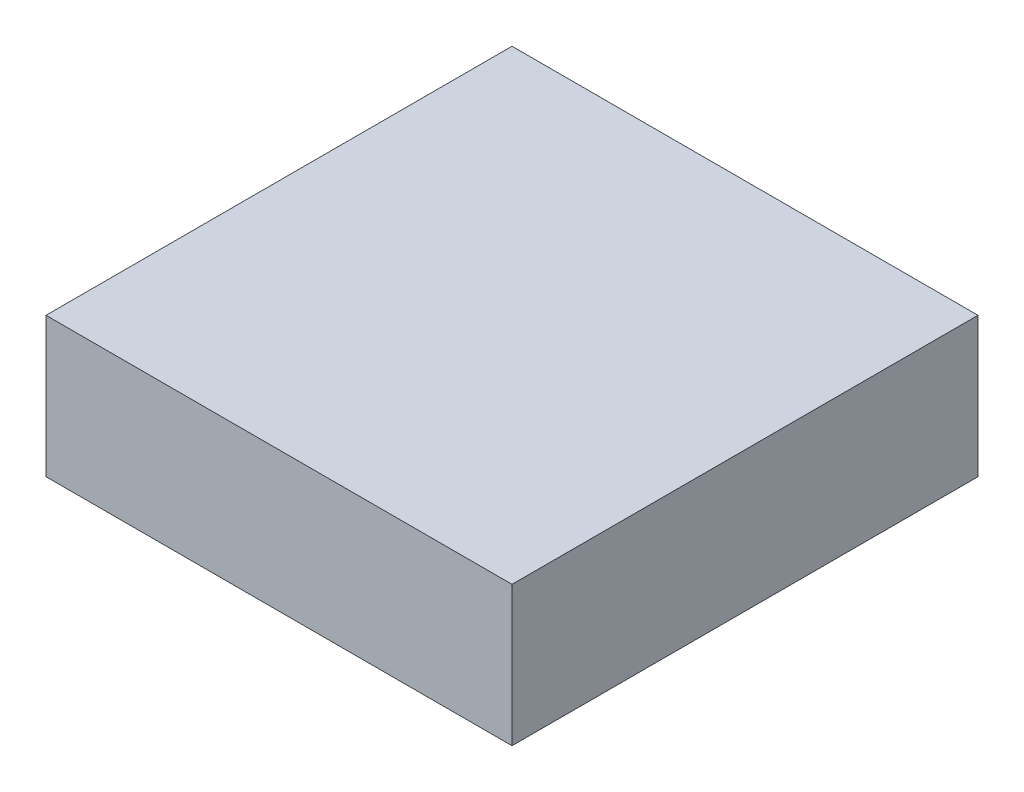
ISO-10303-21;
HEADER;
FILE_DESCRIPTION(('STEP AP214'),'2;1');
FILE_NAME('part.step','',(''),(''),'','','');
FILE_SCHEMA(('AUTOMOTIVE_DESIGN { 1 0 10303 214 1 1 1 1 }'));
ENDSEC;
DATA;
#1=APPLICATION_CONTEXT('core data for automotive mechanical design processes');
#2=APPLICATION_PROTOCOL_DEFINITION('international standard','automotive_design',2000,#1);
#3=PRODUCT_CONTEXT('',#1,'mechanical');
#4=PRODUCT('Part','Part','',(#3));
#5=PRODUCT_RELATED_PRODUCT_CATEGORY('part','',(#4));
#6=PRODUCT_DEFINITION_FORMATION('','',#4);
#7=PRODUCT_DEFINITION_CONTEXT('part definition',#1,'design');
#8=PRODUCT_DEFINITION('design','',#6,#7);
#9=PRODUCT_DEFINITION_SHAPE('','',#8);
#10=(LENGTH_UNIT() NAMED_UNIT(*) SI_UNIT(.MILLI.,.METRE.));
#11=(NAMED_UNIT(*) PLANE_ANGLE_UNIT() SI_UNIT($,.RADIAN.));
#12=(NAMED_UNIT(*) SI_UNIT($,.STERADIAN.) SOLID_ANGLE_UNIT());
#13=UNCERTAINTY_MEASURE_WITH_UNIT(LENGTH_MEASURE(1.E-05),#10,'distance_accuracy_value','');
#14=(GEOMETRIC_REPRESENTATION_CONTEXT(3) GLOBAL_UNCERTAINTY_ASSIGNED_CONTEXT((#13)) GLOBAL_UNIT_ASSIGNED_CONTEXT((#10,
#11,#12)) REPRESENTATION_CONTEXT('',''));
#15=CARTESIAN_POINT('',(0.,0.,0.));
#16=DIRECTION('',(0.,0.,1.));
#17=DIRECTION('',(1.,0.,0.));
#18=AXIS2_PLACEMENT_3D('',#15,#16,#17);
#19=CARTESIAN_POINT('',(0.,38.1,0.));
#20=DIRECTION('',(1.,0.,0.));
#21=DIRECTION('',(0.,0.,-1.));
#22=AXIS2_PLACEMENT_3D('',#19,#20,#21);
#23=PLANE('',#22);
#24=DIRECTION('',(0.,0.,1.));
#25=VECTOR('',#24,1.);
#26=CARTESIAN_POINT('',(0.,0.,0.));
#27=LINE('',#26,#25);
#28=CARTESIAN_POINT('',(0.,0.,-127.));
#29=VERTEX_POINT('',#28);
#30=CARTESIAN_POINT('',(0.,0.,0.));
#31=VERTEX_POINT('',#30);
#32=EDGE_CURVE('E100',#29,#31,#27,.T.);
#33=ORIENTED_EDGE('',*,*,#32,.T.);
#34=DIRECTION('',(0.,-1.,0.));
#35=VECTOR('',#34,1.);
#36=CARTESIAN_POINT('',(0.,38.1,0.));
#37=LINE('',#36,#35);
#38=CARTESIAN_POINT('',(0.,38.1,0.));
#39=VERTEX_POINT('',#38);
#40=EDGE_CURVE('E11',#39,#31,#37,.T.);
#41=ORIENTED_EDGE('',*,*,#40,.F.);
#42=DIRECTION('',(0.,0.,1.));
#43=VECTOR('',#42,1.);
#44=CARTESIAN_POINT('',(0.,38.1,0.));
#45=LINE('',#44,#43);
#46=CARTESIAN_POINT('',(0.,38.1,-127.));
#47=VERTEX_POINT('',#46);
#48=EDGE_CURVE('E88',#47,#39,#45,.T.);
#49=ORIENTED_EDGE('',*,*,#48,.F.);
#50=DIRECTION('',(0.,-1.,0.));
#51=VECTOR('',#50,1.);
#52=CARTESIAN_POINT('',(0.,38.1,-127.));
#53=LINE('',#52,#51);
#54=EDGE_CURVE('E96',#47,#29,#53,.T.);
#55=ORIENTED_EDGE('',*,*,#54,.T.);
#56=EDGE_LOOP('',(#33,#41,#49,#55));
#57=FACE_BOUND('',#56,.T.);
#58=ADVANCED_FACE('F37',(#57),#23,.F.);
#59=CARTESIAN_POINT('',(0.,38.1,0.));
#60=DIRECTION('',(0.,0.,-1.));
#61=DIRECTION('',(-1.,0.,0.));
#62=AXIS2_PLACEMENT_3D('',#59,#60,#61);
#63=PLANE('',#62);
#64=DIRECTION('',(1.,0.,0.));
#65=VECTOR('',#64,1.);
#66=CARTESIAN_POINT('',(0.,0.,0.));
#67=LINE('',#66,#65);
#68=CARTESIAN_POINT('',(127.,0.,0.));
#69=VERTEX_POINT('',#68);
#70=EDGE_CURVE('E92',#31,#69,#67,.T.);
#71=ORIENTED_EDGE('',*,*,#70,.T.);
#72=DIRECTION('',(0.,-1.,0.));
#73=VECTOR('',#72,1.);
#74=CARTESIAN_POINT('',(127.,38.1,0.));
#75=LINE('',#74,#73);
#76=CARTESIAN_POINT('',(127.,38.1,0.));
#77=VERTEX_POINT('',#76);
#78=EDGE_CURVE('E45',#77,#69,#75,.T.);
#79=ORIENTED_EDGE('',*,*,#78,.F.);
#80=DIRECTION('',(1.,0.,0.));
#81=VECTOR('',#80,1.);
#82=CARTESIAN_POINT('',(0.,38.1,0.));
#83=LINE('',#82,#81);
#84=EDGE_CURVE('E83',#39,#77,#83,.T.);
#85=ORIENTED_EDGE('',*,*,#84,.F.);
#86=ORIENTED_EDGE('',*,*,#40,.T.);
#87=EDGE_LOOP('',(#71,#79,#85,#86));
#88=FACE_BOUND('',#87,.T.);
#89=ADVANCED_FACE('F91',(#88),#63,.F.);
#90=CARTESIAN_POINT('',(127.,38.1,0.));
#91=DIRECTION('',(-1.,0.,0.));
#92=DIRECTION('',(0.,0.,1.));
#93=AXIS2_PLACEMENT_3D('',#90,#91,#92);
#94=PLANE('',#93);
#95=DIRECTION('',(0.,0.,-1.));
#96=VECTOR('',#95,1.);
#97=CARTESIAN_POINT('',(127.,0.,0.));
#98=LINE('',#97,#96);
#99=CARTESIAN_POINT('',(127.,0.,-127.));
#100=VERTEX_POINT('',#99);
#101=EDGE_CURVE('E70',#69,#100,#98,.T.);
#102=ORIENTED_EDGE('',*,*,#101,.T.);
#103=DIRECTION('',(0.,-1.,0.));
#104=VECTOR('',#103,1.);
#105=CARTESIAN_POINT('',(127.,38.1,-127.));
#106=LINE('',#105,#104);
#107=CARTESIAN_POINT('',(127.,38.1,-127.));
#108=VERTEX_POINT('',#107);
#109=EDGE_CURVE('E93',#108,#100,#106,.T.);
#110=ORIENTED_EDGE('',*,*,#109,.F.);
#111=DIRECTION('',(0.,0.,-1.));
#112=VECTOR('',#111,1.);
#113=CARTESIAN_POINT('',(127.,38.1,0.));
#114=LINE('',#113,#112);
#115=EDGE_CURVE('E86',#77,#108,#114,.T.);
#116=ORIENTED_EDGE('',*,*,#115,.F.);
#117=ORIENTED_EDGE('',*,*,#78,.T.);
#118=EDGE_LOOP('',(#102,#110,#116,#117));
#119=FACE_BOUND('',#118,.T.);
#120=ADVANCED_FACE('F94',(#119),#94,.F.);
#121=CARTESIAN_POINT('',(0.,38.1,-127.));
#122=DIRECTION('',(0.,0.,1.));
#123=DIRECTION('',(1.,0.,0.));
#124=AXIS2_PLACEMENT_3D('',#121,#122,#123);
#125=PLANE('',#124);
#126=DIRECTION('',(-1.,0.,0.));
#127=VECTOR('',#126,1.);
#128=CARTESIAN_POINT('',(0.,0.,-127.));
#129=LINE('',#128,#127);
#130=EDGE_CURVE('E76',#100,#29,#129,.T.);
#131=ORIENTED_EDGE('',*,*,#130,.T.);
#132=ORIENTED_EDGE('',*,*,#54,.F.);
#133=DIRECTION('',(-1.,0.,0.));
#134=VECTOR('',#133,1.);
#135=CARTESIAN_POINT('',(0.,38.1,-127.));
#136=LINE('',#135,#134);
#137=EDGE_CURVE('E53',#108,#47,#136,.T.);
#138=ORIENTED_EDGE('',*,*,#137,.F.);
#139=ORIENTED_EDGE('',*,*,#109,.T.);
#140=EDGE_LOOP('',(#131,#132,#138,#139));
#141=FACE_BOUND('',#140,.T.);
#142=ADVANCED_FACE('F107',(#141),#125,.F.);
#143=CARTESIAN_POINT('',(0.,38.1,0.));
#144=DIRECTION('',(0.,-1.,0.));
#145=DIRECTION('',(0.,0.,-1.));
#146=AXIS2_PLACEMENT_3D('',#143,#144,#145);
#147=PLANE('',#146);
#148=ORIENTED_EDGE('',*,*,#48,.T.);
#149=ORIENTED_EDGE('',*,*,#84,.T.);
#150=ORIENTED_EDGE('',*,*,#115,.T.);
#151=ORIENTED_EDGE('',*,*,#137,.T.);
#152=EDGE_LOOP('',(#148,#149,#150,#151));
#153=FACE_BOUND('',#152,.T.);
#154=ADVANCED_FACE('F84',(#153),#147,.F.);
#155=CARTESIAN_POINT('',(0.,0.,0.));
#156=DIRECTION('',(0.,-1.,0.));
#157=DIRECTION('',(0.,0.,-1.));
#158=AXIS2_PLACEMENT_3D('',#155,#156,#157);
#159=PLANE('',#158);
#160=ORIENTED_EDGE('',*,*,#32,.F.);
#161=ORIENTED_EDGE('',*,*,#130,.F.);
#162=ORIENTED_EDGE('',*,*,#101,.F.);
#163=ORIENTED_EDGE('',*,*,#70,.F.);
#164=EDGE_LOOP('',(#160,#161,#162,#163));
#165=FACE_BOUND('',#164,.T.);
#166=ADVANCED_FACE('F110',(#165),#159,.T.);
#167=CLOSED_SHELL('',(#58,#89,#120,#142,#154,#166));
#168=MANIFOLD_SOLID_BREP('B2',#167);
#169=ADVANCED_BREP_SHAPE_REPRESENTATION('',(#18,#168),#14);
#170=SHAPE_DEFINITION_REPRESENTATION(#9,#169);
ENDSEC;
END-ISO-10303-21;
